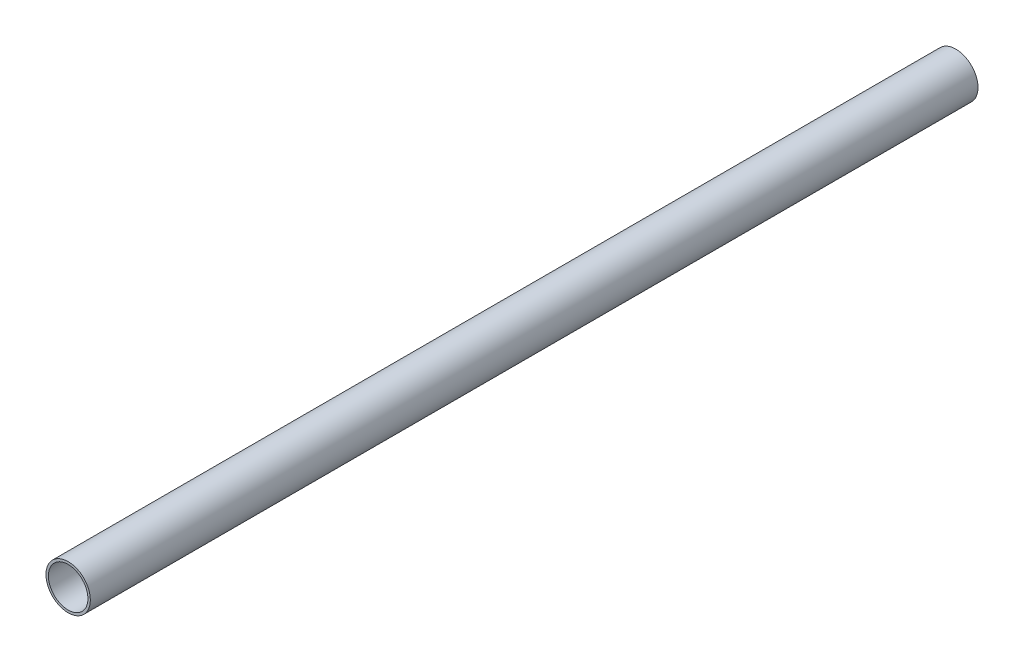
ISO-10303-21;
HEADER;
FILE_DESCRIPTION(('STEP AP214'),'2;1');
FILE_NAME('part.step','',(''),(''),'','','');
FILE_SCHEMA(('AUTOMOTIVE_DESIGN { 1 0 10303 214 1 1 1 1 }'));
ENDSEC;
DATA;
#1=APPLICATION_CONTEXT('core data for automotive mechanical design processes');
#2=APPLICATION_PROTOCOL_DEFINITION('international standard','automotive_design',2000,#1);
#3=PRODUCT_CONTEXT('',#1,'mechanical');
#4=PRODUCT('Part','Part','',(#3));
#5=PRODUCT_RELATED_PRODUCT_CATEGORY('part','',(#4));
#6=PRODUCT_DEFINITION_FORMATION('','',#4);
#7=PRODUCT_DEFINITION_CONTEXT('part definition',#1,'design');
#8=PRODUCT_DEFINITION('design','',#6,#7);
#9=PRODUCT_DEFINITION_SHAPE('','',#8);
#10=(LENGTH_UNIT() NAMED_UNIT(*) SI_UNIT(.MILLI.,.METRE.));
#11=(NAMED_UNIT(*) PLANE_ANGLE_UNIT() SI_UNIT($,.RADIAN.));
#12=(NAMED_UNIT(*) SI_UNIT($,.STERADIAN.) SOLID_ANGLE_UNIT());
#13=UNCERTAINTY_MEASURE_WITH_UNIT(LENGTH_MEASURE(1.E-05),#10,'distance_accuracy_value','');
#14=(GEOMETRIC_REPRESENTATION_CONTEXT(3) GLOBAL_UNCERTAINTY_ASSIGNED_CONTEXT((#13)) GLOBAL_UNIT_ASSIGNED_CONTEXT((#10,
#11,#12)) REPRESENTATION_CONTEXT('',''));
#15=CARTESIAN_POINT('',(0.,0.,0.));
#16=DIRECTION('',(0.,0.,1.));
#17=DIRECTION('',(1.,0.,0.));
#18=AXIS2_PLACEMENT_3D('',#15,#16,#17);
#19=CARTESIAN_POINT('',(0.,0.,0.));
#20=DIRECTION('',(0.,0.,1.));
#21=DIRECTION('',(1.,0.,0.));
#22=AXIS2_PLACEMENT_3D('',#19,#20,#21);
#23=CYLINDRICAL_SURFACE('',#22,4.455);
#24=CARTESIAN_POINT('',(0.,0.,200.));
#25=DIRECTION('',(0.,0.,-1.));
#26=DIRECTION('',(0.,-1.,0.));
#27=AXIS2_PLACEMENT_3D('',#24,#25,#26);
#28=CIRCLE('',#27,4.455);
#29=CARTESIAN_POINT('',(0.,-4.455,200.));
#30=VERTEX_POINT('',#29);
#31=EDGE_CURVE('E26',#30,#30,#28,.T.);
#32=ORIENTED_EDGE('',*,*,#31,.F.);
#33=EDGE_LOOP('',(#32));
#34=FACE_BOUND('',#33,.T.);
#35=CARTESIAN_POINT('',(0.,0.,0.));
#36=DIRECTION('',(0.,0.,-1.));
#37=DIRECTION('',(0.,-1.,0.));
#38=AXIS2_PLACEMENT_3D('',#35,#36,#37);
#39=CIRCLE('',#38,4.455);
#40=CARTESIAN_POINT('',(0.,-4.455,0.));
#41=VERTEX_POINT('',#40);
#42=EDGE_CURVE('E9',#41,#41,#39,.T.);
#43=ORIENTED_EDGE('',*,*,#42,.T.);
#44=EDGE_LOOP('',(#43));
#45=FACE_BOUND('',#44,.T.);
#46=ADVANCED_FACE('F14',(#34,#45),#23,.F.);
#47=CARTESIAN_POINT('',(0.,0.,0.));
#48=DIRECTION('',(0.,0.,1.));
#49=DIRECTION('',(1.,0.,0.));
#50=AXIS2_PLACEMENT_3D('',#47,#48,#49);
#51=CYLINDRICAL_SURFACE('',#50,5.);
#52=CARTESIAN_POINT('',(0.,0.,200.));
#53=DIRECTION('',(0.,0.,1.));
#54=DIRECTION('',(1.,0.,0.));
#55=AXIS2_PLACEMENT_3D('',#52,#53,#54);
#56=CIRCLE('',#55,5.);
#57=CARTESIAN_POINT('',(5.,0.,200.));
#58=VERTEX_POINT('',#57);
#59=EDGE_CURVE('E28',#58,#58,#56,.T.);
#60=ORIENTED_EDGE('',*,*,#59,.F.);
#61=EDGE_LOOP('',(#60));
#62=FACE_BOUND('',#61,.T.);
#63=CARTESIAN_POINT('',(0.,0.,0.));
#64=DIRECTION('',(0.,0.,1.));
#65=DIRECTION('',(1.,0.,0.));
#66=AXIS2_PLACEMENT_3D('',#63,#64,#65);
#67=CIRCLE('',#66,5.);
#68=CARTESIAN_POINT('',(5.,0.,0.));
#69=VERTEX_POINT('',#68);
#70=EDGE_CURVE('E18',#69,#69,#67,.T.);
#71=ORIENTED_EDGE('',*,*,#70,.T.);
#72=EDGE_LOOP('',(#71));
#73=FACE_BOUND('',#72,.T.);
#74=ADVANCED_FACE('F16',(#62,#73),#51,.T.);
#75=CARTESIAN_POINT('',(0.,0.,200.));
#76=DIRECTION('',(0.,0.,1.));
#77=DIRECTION('',(1.,0.,0.));
#78=AXIS2_PLACEMENT_3D('',#75,#76,#77);
#79=PLANE('',#78);
#80=ORIENTED_EDGE('',*,*,#31,.T.);
#81=EDGE_LOOP('',(#80));
#82=FACE_BOUND('',#81,.T.);
#83=ORIENTED_EDGE('',*,*,#59,.T.);
#84=EDGE_LOOP('',(#83));
#85=FACE_BOUND('',#84,.T.);
#86=ADVANCED_FACE('F35',(#82,#85),#79,.T.);
#87=CARTESIAN_POINT('',(0.,0.,0.));
#88=DIRECTION('',(0.,0.,1.));
#89=DIRECTION('',(1.,0.,0.));
#90=AXIS2_PLACEMENT_3D('',#87,#88,#89);
#91=PLANE('',#90);
#92=ORIENTED_EDGE('',*,*,#42,.F.);
#93=EDGE_LOOP('',(#92));
#94=FACE_BOUND('',#93,.T.);
#95=ORIENTED_EDGE('',*,*,#70,.F.);
#96=EDGE_LOOP('',(#95));
#97=FACE_BOUND('',#96,.T.);
#98=ADVANCED_FACE('F44',(#94,#97),#91,.F.);
#99=CLOSED_SHELL('',(#46,#74,#86,#98));
#100=MANIFOLD_SOLID_BREP('B1',#99);
#101=ADVANCED_BREP_SHAPE_REPRESENTATION('',(#18,#100),#14);
#102=SHAPE_DEFINITION_REPRESENTATION(#9,#101);
ENDSEC;
END-ISO-10303-21;
